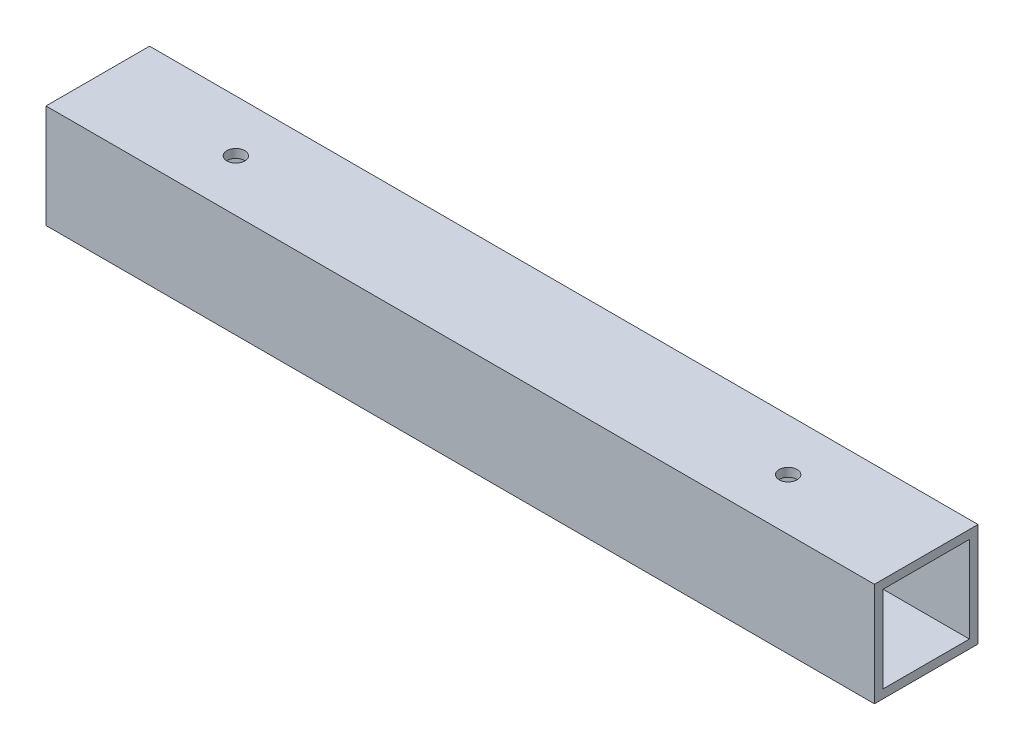
ISO-10303-21;
HEADER;
FILE_DESCRIPTION(('STEP AP214'),'2;1');
FILE_NAME('part.step','',(''),(''),'','','');
FILE_SCHEMA(('AUTOMOTIVE_DESIGN { 1 0 10303 214 1 1 1 1 }'));
ENDSEC;
DATA;
#1=APPLICATION_CONTEXT('core data for automotive mechanical design processes');
#2=APPLICATION_PROTOCOL_DEFINITION('international standard','automotive_design',2000,#1);
#3=PRODUCT_CONTEXT('',#1,'mechanical');
#4=PRODUCT('Part','Part','',(#3));
#5=PRODUCT_RELATED_PRODUCT_CATEGORY('part','',(#4));
#6=PRODUCT_DEFINITION_FORMATION('','',#4);
#7=PRODUCT_DEFINITION_CONTEXT('part definition',#1,'design');
#8=PRODUCT_DEFINITION('design','',#6,#7);
#9=PRODUCT_DEFINITION_SHAPE('','',#8);
#10=(LENGTH_UNIT() NAMED_UNIT(*) SI_UNIT(.MILLI.,.METRE.));
#11=(NAMED_UNIT(*) PLANE_ANGLE_UNIT() SI_UNIT($,.RADIAN.));
#12=(NAMED_UNIT(*) SI_UNIT($,.STERADIAN.) SOLID_ANGLE_UNIT());
#13=UNCERTAINTY_MEASURE_WITH_UNIT(LENGTH_MEASURE(1.E-05),#10,'distance_accuracy_value','');
#14=(GEOMETRIC_REPRESENTATION_CONTEXT(3) GLOBAL_UNCERTAINTY_ASSIGNED_CONTEXT((#13)) GLOBAL_UNIT_ASSIGNED_CONTEXT((#10,
#11,#12)) REPRESENTATION_CONTEXT('',''));
#15=CARTESIAN_POINT('',(0.,0.,0.));
#16=DIRECTION('',(0.,0.,1.));
#17=DIRECTION('',(1.,0.,0.));
#18=AXIS2_PLACEMENT_3D('',#15,#16,#17);
#19=CARTESIAN_POINT('',(101.6,-19.05,0.));
#20=DIRECTION('',(0.,1.,0.));
#21=DIRECTION('',(0.,0.,1.));
#22=AXIS2_PLACEMENT_3D('',#19,#20,#21);
#23=CYLINDRICAL_SURFACE('',#22,3.302);
#24=CARTESIAN_POINT('',(101.6,15.875,0.));
#25=DIRECTION('',(0.,1.,0.));
#26=DIRECTION('',(0.,0.,1.));
#27=AXIS2_PLACEMENT_3D('',#24,#25,#26);
#28=CIRCLE('',#27,3.302);
#29=CARTESIAN_POINT('',(101.6,15.875,3.302));
#30=VERTEX_POINT('',#29);
#31=EDGE_CURVE('E123',#30,#30,#28,.T.);
#32=ORIENTED_EDGE('',*,*,#31,.F.);
#33=EDGE_LOOP('',(#32));
#34=FACE_BOUND('',#33,.T.);
#35=CARTESIAN_POINT('',(101.6,19.05,0.));
#36=DIRECTION('',(0.,1.,0.));
#37=DIRECTION('',(0.,0.,1.));
#38=AXIS2_PLACEMENT_3D('',#35,#36,#37);
#39=CIRCLE('',#38,3.302);
#40=CARTESIAN_POINT('',(101.6,19.05,3.302));
#41=VERTEX_POINT('',#40);
#42=EDGE_CURVE('E120',#41,#41,#39,.F.);
#43=ORIENTED_EDGE('',*,*,#42,.F.);
#44=EDGE_LOOP('',(#43));
#45=FACE_BOUND('',#44,.T.);
#46=ADVANCED_FACE('F17',(#34,#45),#23,.F.);
#47=CARTESIAN_POINT('',(-101.6,-19.05,0.));
#48=DIRECTION('',(0.,-1.,0.));
#49=DIRECTION('',(0.,0.,-1.));
#50=AXIS2_PLACEMENT_3D('',#47,#48,#49);
#51=CYLINDRICAL_SURFACE('',#50,3.302);
#52=CARTESIAN_POINT('',(-101.6,19.05,0.));
#53=DIRECTION('',(0.,-1.,0.));
#54=DIRECTION('',(0.,0.,-1.));
#55=AXIS2_PLACEMENT_3D('',#52,#53,#54);
#56=CIRCLE('',#55,3.302);
#57=CARTESIAN_POINT('',(-101.6,19.05,-3.302));
#58=VERTEX_POINT('',#57);
#59=EDGE_CURVE('E116',#58,#58,#56,.T.);
#60=ORIENTED_EDGE('',*,*,#59,.F.);
#61=EDGE_LOOP('',(#60));
#62=FACE_BOUND('',#61,.T.);
#63=CARTESIAN_POINT('',(-101.6,15.875,0.));
#64=DIRECTION('',(0.,-1.,0.));
#65=DIRECTION('',(0.,0.,-1.));
#66=AXIS2_PLACEMENT_3D('',#63,#64,#65);
#67=CIRCLE('',#66,3.302);
#68=CARTESIAN_POINT('',(-101.6,15.875,-3.302));
#69=VERTEX_POINT('',#68);
#70=EDGE_CURVE('E121',#69,#69,#67,.F.);
#71=ORIENTED_EDGE('',*,*,#70,.F.);
#72=EDGE_LOOP('',(#71));
#73=FACE_BOUND('',#72,.T.);
#74=ADVANCED_FACE('F153',(#62,#73),#51,.F.);
#75=CARTESIAN_POINT('',(101.6,-19.05,0.));
#76=DIRECTION('',(0.,1.,0.));
#77=DIRECTION('',(0.,0.,1.));
#78=AXIS2_PLACEMENT_3D('',#75,#76,#77);
#79=CYLINDRICAL_SURFACE('',#78,11.1125);
#80=CARTESIAN_POINT('',(101.6,-15.875,0.));
#81=DIRECTION('',(0.,1.,0.));
#82=DIRECTION('',(0.,0.,1.));
#83=AXIS2_PLACEMENT_3D('',#80,#81,#82);
#84=CIRCLE('',#83,11.1125);
#85=CARTESIAN_POINT('',(101.6,-15.875,11.1125));
#86=VERTEX_POINT('',#85);
#87=EDGE_CURVE('E20',#86,#86,#84,.F.);
#88=ORIENTED_EDGE('',*,*,#87,.F.);
#89=EDGE_LOOP('',(#88));
#90=FACE_BOUND('',#89,.T.);
#91=CARTESIAN_POINT('',(101.6,-19.05,0.));
#92=DIRECTION('',(0.,1.,0.));
#93=DIRECTION('',(0.,0.,1.));
#94=AXIS2_PLACEMENT_3D('',#91,#92,#93);
#95=CIRCLE('',#94,11.1125);
#96=CARTESIAN_POINT('',(101.6,-19.05,11.1125));
#97=VERTEX_POINT('',#96);
#98=EDGE_CURVE('E131',#97,#97,#95,.T.);
#99=ORIENTED_EDGE('',*,*,#98,.F.);
#100=EDGE_LOOP('',(#99));
#101=FACE_BOUND('',#100,.T.);
#102=ADVANCED_FACE('F149',(#90,#101),#79,.F.);
#103=CARTESIAN_POINT('',(-101.6,-19.05,0.));
#104=DIRECTION('',(0.,1.,0.));
#105=DIRECTION('',(0.,0.,1.));
#106=AXIS2_PLACEMENT_3D('',#103,#104,#105);
#107=CYLINDRICAL_SURFACE('',#106,11.1125);
#108=CARTESIAN_POINT('',(-101.6,-15.875,0.));
#109=DIRECTION('',(0.,1.,0.));
#110=DIRECTION('',(0.,0.,1.));
#111=AXIS2_PLACEMENT_3D('',#108,#109,#110);
#112=CIRCLE('',#111,11.1125);
#113=CARTESIAN_POINT('',(-101.6,-15.875,11.1125));
#114=VERTEX_POINT('',#113);
#115=EDGE_CURVE('E92',#114,#114,#112,.F.);
#116=ORIENTED_EDGE('',*,*,#115,.F.);
#117=EDGE_LOOP('',(#116));
#118=FACE_BOUND('',#117,.T.);
#119=CARTESIAN_POINT('',(-101.6,-19.05,0.));
#120=DIRECTION('',(0.,1.,0.));
#121=DIRECTION('',(0.,0.,1.));
#122=AXIS2_PLACEMENT_3D('',#119,#120,#121);
#123=CIRCLE('',#122,11.1125);
#124=CARTESIAN_POINT('',(-101.6,-19.05,11.1125));
#125=VERTEX_POINT('',#124);
#126=EDGE_CURVE('E127',#125,#125,#123,.T.);
#127=ORIENTED_EDGE('',*,*,#126,.F.);
#128=EDGE_LOOP('',(#127));
#129=FACE_BOUND('',#128,.T.);
#130=ADVANCED_FACE('F152',(#118,#129),#107,.F.);
#131=CARTESIAN_POINT('',(-152.4,19.05,19.05));
#132=DIRECTION('',(0.,0.,1.));
#133=DIRECTION('',(1.,0.,0.));
#134=AXIS2_PLACEMENT_3D('',#131,#132,#133);
#135=PLANE('',#134);
#136=DIRECTION('',(1.,0.,0.));
#137=VECTOR('',#136,1.);
#138=CARTESIAN_POINT('',(-152.4,19.05,19.05));
#139=LINE('',#138,#137);
#140=CARTESIAN_POINT('',(-152.4,19.05,19.05));
#141=VERTEX_POINT('',#140);
#142=CARTESIAN_POINT('',(152.4,19.05,19.05));
#143=VERTEX_POINT('',#142);
#144=EDGE_CURVE('E117',#141,#143,#139,.T.);
#145=ORIENTED_EDGE('',*,*,#144,.F.);
#146=DIRECTION('',(0.,1.,0.));
#147=VECTOR('',#146,1.);
#148=CARTESIAN_POINT('',(-152.4,0.,19.05));
#149=LINE('',#148,#147);
#150=CARTESIAN_POINT('',(-152.4,-19.05,19.05));
#151=VERTEX_POINT('',#150);
#152=EDGE_CURVE('E171',#141,#151,#149,.F.);
#153=ORIENTED_EDGE('',*,*,#152,.T.);
#154=DIRECTION('',(1.,0.,0.));
#155=VECTOR('',#154,1.);
#156=CARTESIAN_POINT('',(-152.4,-19.05,19.05));
#157=LINE('',#156,#155);
#158=CARTESIAN_POINT('',(152.4,-19.05,19.05));
#159=VERTEX_POINT('',#158);
#160=EDGE_CURVE('E134',#159,#151,#157,.F.);
#161=ORIENTED_EDGE('',*,*,#160,.F.);
#162=DIRECTION('',(0.,1.,0.));
#163=VECTOR('',#162,1.);
#164=CARTESIAN_POINT('',(152.4,0.,19.05));
#165=LINE('',#164,#163);
#166=EDGE_CURVE('E111',#143,#159,#165,.F.);
#167=ORIENTED_EDGE('',*,*,#166,.F.);
#168=EDGE_LOOP('',(#145,#153,#161,#167));
#169=FACE_BOUND('',#168,.T.);
#170=ADVANCED_FACE('F204',(#169),#135,.T.);
#171=CARTESIAN_POINT('',(-152.4,15.875,-15.875));
#172=DIRECTION('',(0.,0.,1.));
#173=DIRECTION('',(1.,0.,0.));
#174=AXIS2_PLACEMENT_3D('',#171,#172,#173);
#175=PLANE('',#174);
#176=DIRECTION('',(1.,0.,0.));
#177=VECTOR('',#176,1.);
#178=CARTESIAN_POINT('',(-152.4,15.875,-15.875));
#179=LINE('',#178,#177);
#180=CARTESIAN_POINT('',(-152.4,15.875,-15.875));
#181=VERTEX_POINT('',#180);
#182=CARTESIAN_POINT('',(152.4,15.875,-15.875));
#183=VERTEX_POINT('',#182);
#184=EDGE_CURVE('E91',#181,#183,#179,.T.);
#185=ORIENTED_EDGE('',*,*,#184,.F.);
#186=DIRECTION('',(0.,1.,0.));
#187=VECTOR('',#186,1.);
#188=CARTESIAN_POINT('',(-152.4,0.,-15.875));
#189=LINE('',#188,#187);
#190=CARTESIAN_POINT('',(-152.4,-15.875,-15.875));
#191=VERTEX_POINT('',#190);
#192=EDGE_CURVE('E173',#181,#191,#189,.F.);
#193=ORIENTED_EDGE('',*,*,#192,.T.);
#194=DIRECTION('',(1.,0.,0.));
#195=VECTOR('',#194,1.);
#196=CARTESIAN_POINT('',(-152.4,-15.875,-15.875));
#197=LINE('',#196,#195);
#198=CARTESIAN_POINT('',(152.4,-15.875,-15.875));
#199=VERTEX_POINT('',#198);
#200=EDGE_CURVE('E125',#199,#191,#197,.F.);
#201=ORIENTED_EDGE('',*,*,#200,.F.);
#202=DIRECTION('',(0.,1.,0.));
#203=VECTOR('',#202,1.);
#204=CARTESIAN_POINT('',(152.4,0.,-15.875));
#205=LINE('',#204,#203);
#206=EDGE_CURVE('E107',#183,#199,#205,.F.);
#207=ORIENTED_EDGE('',*,*,#206,.F.);
#208=EDGE_LOOP('',(#185,#193,#201,#207));
#209=FACE_BOUND('',#208,.T.);
#210=ADVANCED_FACE('F189',(#209),#175,.T.);
#211=CARTESIAN_POINT('',(-152.4,-15.875,-15.875));
#212=DIRECTION('',(0.,1.,0.));
#213=DIRECTION('',(0.,0.,1.));
#214=AXIS2_PLACEMENT_3D('',#211,#212,#213);
#215=PLANE('',#214);
#216=ORIENTED_EDGE('',*,*,#115,.T.);
#217=EDGE_LOOP('',(#216));
#218=FACE_BOUND('',#217,.T.);
#219=ORIENTED_EDGE('',*,*,#87,.T.);
#220=EDGE_LOOP('',(#219));
#221=FACE_BOUND('',#220,.T.);
#222=ORIENTED_EDGE('',*,*,#200,.T.);
#223=DIRECTION('',(0.,0.,-1.));
#224=VECTOR('',#223,1.);
#225=CARTESIAN_POINT('',(-152.4,-15.875,0.));
#226=LINE('',#225,#224);
#227=CARTESIAN_POINT('',(-152.4,-15.875,15.875));
#228=VERTEX_POINT('',#227);
#229=EDGE_CURVE('E88',#191,#228,#226,.F.);
#230=ORIENTED_EDGE('',*,*,#229,.T.);
#231=DIRECTION('',(-1.,0.,0.));
#232=VECTOR('',#231,1.);
#233=CARTESIAN_POINT('',(-152.4,-15.875,15.875));
#234=LINE('',#233,#232);
#235=CARTESIAN_POINT('',(152.4,-15.875,15.875));
#236=VERTEX_POINT('',#235);
#237=EDGE_CURVE('E80',#236,#228,#234,.T.);
#238=ORIENTED_EDGE('',*,*,#237,.F.);
#239=DIRECTION('',(0.,0.,-1.));
#240=VECTOR('',#239,1.);
#241=CARTESIAN_POINT('',(152.4,-15.875,0.));
#242=LINE('',#241,#240);
#243=EDGE_CURVE('E85',#199,#236,#242,.F.);
#244=ORIENTED_EDGE('',*,*,#243,.F.);
#245=EDGE_LOOP('',(#222,#230,#238,#244));
#246=FACE_BOUND('',#245,.T.);
#247=ADVANCED_FACE('F83',(#218,#221,#246),#215,.T.);
#248=CARTESIAN_POINT('',(-152.4,-15.875,15.875));
#249=DIRECTION('',(0.,0.,-1.));
#250=DIRECTION('',(-1.,0.,0.));
#251=AXIS2_PLACEMENT_3D('',#248,#249,#250);
#252=PLANE('',#251);
#253=ORIENTED_EDGE('',*,*,#237,.T.);
#254=DIRECTION('',(0.,1.,0.));
#255=VECTOR('',#254,1.);
#256=CARTESIAN_POINT('',(-152.4,0.,15.875));
#257=LINE('',#256,#255);
#258=CARTESIAN_POINT('',(-152.4,15.875,15.875));
#259=VERTEX_POINT('',#258);
#260=EDGE_CURVE('E191',#228,#259,#257,.T.);
#261=ORIENTED_EDGE('',*,*,#260,.T.);
#262=DIRECTION('',(1.,0.,0.));
#263=VECTOR('',#262,1.);
#264=CARTESIAN_POINT('',(-152.4,15.875,15.875));
#265=LINE('',#264,#263);
#266=CARTESIAN_POINT('',(152.4,15.875,15.875));
#267=VERTEX_POINT('',#266);
#268=EDGE_CURVE('E98',#267,#259,#265,.F.);
#269=ORIENTED_EDGE('',*,*,#268,.F.);
#270=DIRECTION('',(0.,1.,0.));
#271=VECTOR('',#270,1.);
#272=CARTESIAN_POINT('',(152.4,0.,15.875));
#273=LINE('',#272,#271);
#274=EDGE_CURVE('E95',#236,#267,#273,.T.);
#275=ORIENTED_EDGE('',*,*,#274,.F.);
#276=EDGE_LOOP('',(#253,#261,#269,#275));
#277=FACE_BOUND('',#276,.T.);
#278=ADVANCED_FACE('F96',(#277),#252,.T.);
#279=CARTESIAN_POINT('',(-152.4,15.875,15.875));
#280=DIRECTION('',(0.,-1.,0.));
#281=DIRECTION('',(0.,0.,-1.));
#282=AXIS2_PLACEMENT_3D('',#279,#280,#281);
#283=PLANE('',#282);
#284=ORIENTED_EDGE('',*,*,#70,.T.);
#285=EDGE_LOOP('',(#284));
#286=FACE_BOUND('',#285,.T.);
#287=ORIENTED_EDGE('',*,*,#31,.T.);
#288=EDGE_LOOP('',(#287));
#289=FACE_BOUND('',#288,.T.);
#290=ORIENTED_EDGE('',*,*,#268,.T.);
#291=DIRECTION('',(0.,0.,-1.));
#292=VECTOR('',#291,1.);
#293=CARTESIAN_POINT('',(-152.4,15.875,0.));
#294=LINE('',#293,#292);
#295=EDGE_CURVE('E186',#259,#181,#294,.T.);
#296=ORIENTED_EDGE('',*,*,#295,.T.);
#297=ORIENTED_EDGE('',*,*,#184,.T.);
#298=DIRECTION('',(0.,0.,-1.));
#299=VECTOR('',#298,1.);
#300=CARTESIAN_POINT('',(152.4,15.875,0.));
#301=LINE('',#300,#299);
#302=EDGE_CURVE('E102',#267,#183,#301,.T.);
#303=ORIENTED_EDGE('',*,*,#302,.F.);
#304=EDGE_LOOP('',(#290,#296,#297,#303));
#305=FACE_BOUND('',#304,.T.);
#306=ADVANCED_FACE('F183',(#286,#289,#305),#283,.T.);
#307=CARTESIAN_POINT('',(-152.4,19.05,-19.05));
#308=DIRECTION('',(0.,1.,0.));
#309=DIRECTION('',(0.,0.,1.));
#310=AXIS2_PLACEMENT_3D('',#307,#308,#309);
#311=PLANE('',#310);
#312=ORIENTED_EDGE('',*,*,#59,.T.);
#313=EDGE_LOOP('',(#312));
#314=FACE_BOUND('',#313,.T.);
#315=ORIENTED_EDGE('',*,*,#42,.T.);
#316=EDGE_LOOP('',(#315));
#317=FACE_BOUND('',#316,.T.);
#318=DIRECTION('',(-1.,0.,0.));
#319=VECTOR('',#318,1.);
#320=CARTESIAN_POINT('',(-152.4,19.05,-19.05));
#321=LINE('',#320,#319);
#322=CARTESIAN_POINT('',(-152.4,19.05,-19.05));
#323=VERTEX_POINT('',#322);
#324=CARTESIAN_POINT('',(152.4,19.05,-19.05));
#325=VERTEX_POINT('',#324);
#326=EDGE_CURVE('E195',#323,#325,#321,.F.);
#327=ORIENTED_EDGE('',*,*,#326,.F.);
#328=DIRECTION('',(0.,0.,-1.));
#329=VECTOR('',#328,1.);
#330=CARTESIAN_POINT('',(-152.4,19.05,0.));
#331=LINE('',#330,#329);
#332=EDGE_CURVE('E130',#323,#141,#331,.F.);
#333=ORIENTED_EDGE('',*,*,#332,.T.);
#334=ORIENTED_EDGE('',*,*,#144,.T.);
#335=DIRECTION('',(0.,0.,-1.));
#336=VECTOR('',#335,1.);
#337=CARTESIAN_POINT('',(152.4,19.05,0.));
#338=LINE('',#337,#336);
#339=EDGE_CURVE('E108',#325,#143,#338,.F.);
#340=ORIENTED_EDGE('',*,*,#339,.F.);
#341=EDGE_LOOP('',(#327,#333,#334,#340));
#342=FACE_BOUND('',#341,.T.);
#343=ADVANCED_FACE('F206',(#314,#317,#342),#311,.T.);
#344=CARTESIAN_POINT('',(152.4,0.,0.));
#345=DIRECTION('',(1.,0.,0.));
#346=DIRECTION('',(0.,0.,-1.));
#347=AXIS2_PLACEMENT_3D('',#344,#345,#346);
#348=PLANE('',#347);
#349=ORIENTED_EDGE('',*,*,#302,.T.);
#350=ORIENTED_EDGE('',*,*,#206,.T.);
#351=ORIENTED_EDGE('',*,*,#243,.T.);
#352=ORIENTED_EDGE('',*,*,#274,.T.);
#353=EDGE_LOOP('',(#349,#350,#351,#352));
#354=FACE_BOUND('',#353,.T.);
#355=DIRECTION('',(0.,1.,0.));
#356=VECTOR('',#355,1.);
#357=CARTESIAN_POINT('',(152.4,-19.05,-19.05));
#358=LINE('',#357,#356);
#359=CARTESIAN_POINT('',(152.4,-19.05,-19.05));
#360=VERTEX_POINT('',#359);
#361=EDGE_CURVE('E198',#325,#360,#358,.F.);
#362=ORIENTED_EDGE('',*,*,#361,.F.);
#363=ORIENTED_EDGE('',*,*,#339,.T.);
#364=ORIENTED_EDGE('',*,*,#166,.T.);
#365=DIRECTION('',(0.,0.,-1.));
#366=VECTOR('',#365,1.);
#367=CARTESIAN_POINT('',(152.4,-19.05,19.05));
#368=LINE('',#367,#366);
#369=EDGE_CURVE('E164',#360,#159,#368,.F.);
#370=ORIENTED_EDGE('',*,*,#369,.F.);
#371=EDGE_LOOP('',(#362,#363,#364,#370));
#372=FACE_BOUND('',#371,.T.);
#373=ADVANCED_FACE('F104',(#354,#372),#348,.T.);
#374=CARTESIAN_POINT('',(-152.4,-19.05,19.05));
#375=DIRECTION('',(0.,-1.,0.));
#376=DIRECTION('',(0.,0.,-1.));
#377=AXIS2_PLACEMENT_3D('',#374,#375,#376);
#378=PLANE('',#377);
#379=ORIENTED_EDGE('',*,*,#126,.T.);
#380=EDGE_LOOP('',(#379));
#381=FACE_BOUND('',#380,.T.);
#382=ORIENTED_EDGE('',*,*,#98,.T.);
#383=EDGE_LOOP('',(#382));
#384=FACE_BOUND('',#383,.T.);
#385=ORIENTED_EDGE('',*,*,#160,.T.);
#386=DIRECTION('',(0.,0.,-1.));
#387=VECTOR('',#386,1.);
#388=CARTESIAN_POINT('',(-152.4,-19.05,0.));
#389=LINE('',#388,#387);
#390=CARTESIAN_POINT('',(-152.4,-19.05,-19.05));
#391=VERTEX_POINT('',#390);
#392=EDGE_CURVE('E35',#151,#391,#389,.T.);
#393=ORIENTED_EDGE('',*,*,#392,.T.);
#394=DIRECTION('',(-1.,0.,0.));
#395=VECTOR('',#394,1.);
#396=CARTESIAN_POINT('',(-152.4,-19.05,-19.05));
#397=LINE('',#396,#395);
#398=EDGE_CURVE('E26',#360,#391,#397,.T.);
#399=ORIENTED_EDGE('',*,*,#398,.F.);
#400=ORIENTED_EDGE('',*,*,#369,.T.);
#401=EDGE_LOOP('',(#385,#393,#399,#400));
#402=FACE_BOUND('',#401,.T.);
#403=ADVANCED_FACE('F157',(#381,#384,#402),#378,.T.);
#404=CARTESIAN_POINT('',(-152.4,0.,0.));
#405=DIRECTION('',(1.,0.,0.));
#406=DIRECTION('',(0.,0.,-1.));
#407=AXIS2_PLACEMENT_3D('',#404,#405,#406);
#408=PLANE('',#407);
#409=ORIENTED_EDGE('',*,*,#260,.F.);
#410=ORIENTED_EDGE('',*,*,#229,.F.);
#411=ORIENTED_EDGE('',*,*,#192,.F.);
#412=ORIENTED_EDGE('',*,*,#295,.F.);
#413=EDGE_LOOP('',(#409,#410,#411,#412));
#414=FACE_BOUND('',#413,.T.);
#415=ORIENTED_EDGE('',*,*,#392,.F.);
#416=ORIENTED_EDGE('',*,*,#152,.F.);
#417=ORIENTED_EDGE('',*,*,#332,.F.);
#418=DIRECTION('',(0.,1.,0.));
#419=VECTOR('',#418,1.);
#420=CARTESIAN_POINT('',(-152.4,-19.05,-19.05));
#421=LINE('',#420,#419);
#422=EDGE_CURVE('E11',#391,#323,#421,.T.);
#423=ORIENTED_EDGE('',*,*,#422,.F.);
#424=EDGE_LOOP('',(#415,#416,#417,#423));
#425=FACE_BOUND('',#424,.T.);
#426=ADVANCED_FACE('F159',(#414,#425),#408,.F.);
#427=CARTESIAN_POINT('',(-152.4,-19.05,-19.05));
#428=DIRECTION('',(0.,0.,-1.));
#429=DIRECTION('',(-1.,0.,0.));
#430=AXIS2_PLACEMENT_3D('',#427,#428,#429);
#431=PLANE('',#430);
#432=ORIENTED_EDGE('',*,*,#398,.T.);
#433=ORIENTED_EDGE('',*,*,#422,.T.);
#434=ORIENTED_EDGE('',*,*,#326,.T.);
#435=ORIENTED_EDGE('',*,*,#361,.T.);
#436=EDGE_LOOP('',(#432,#433,#434,#435));
#437=FACE_BOUND('',#436,.T.);
#438=ADVANCED_FACE('F202',(#437),#431,.T.);
#439=CLOSED_SHELL('',(#46,#74,#102,#130,#170,#210,#247,#278,#306,#343,#373,#403,#426,#438));
#440=MANIFOLD_SOLID_BREP('B1',#439);
#441=ADVANCED_BREP_SHAPE_REPRESENTATION('',(#18,#440),#14);
#442=SHAPE_DEFINITION_REPRESENTATION(#9,#441);
ENDSEC;
END-ISO-10303-21;
